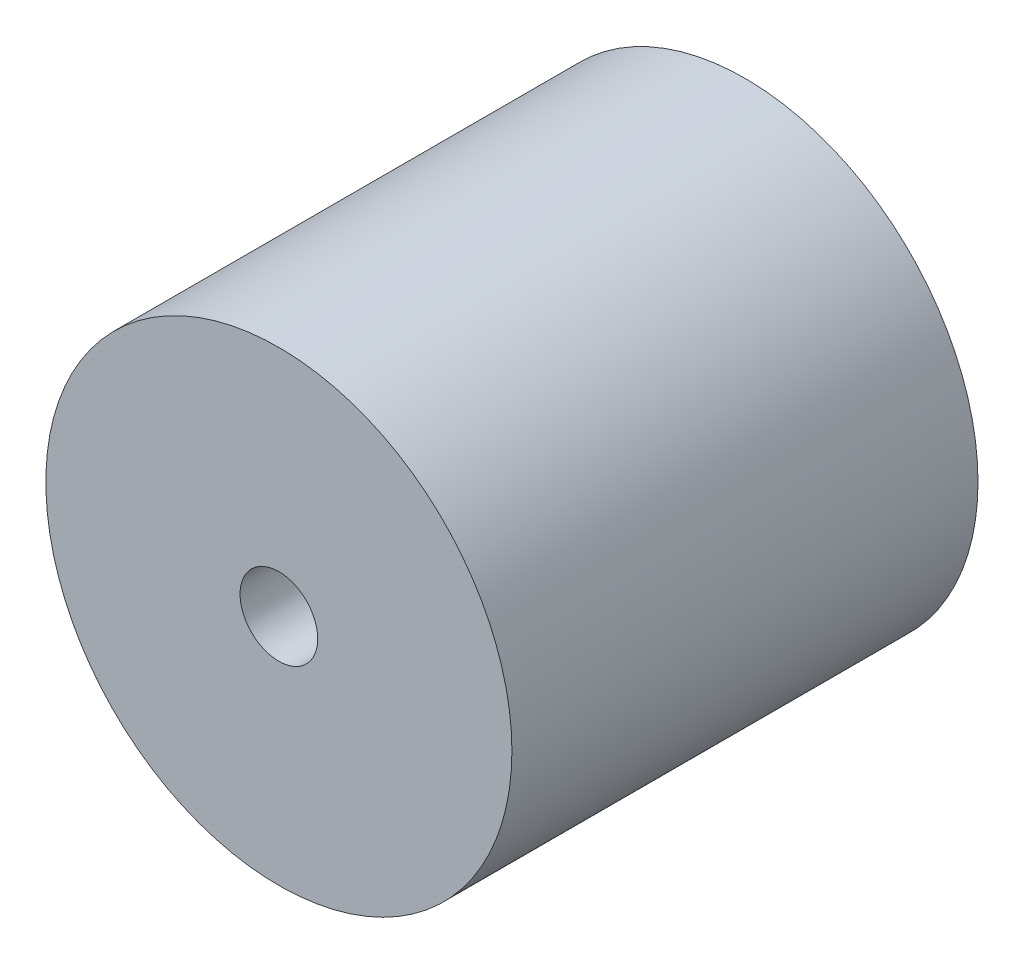
ISO-10303-21;
HEADER;
FILE_DESCRIPTION(('STEP AP214'),'2;1');
FILE_NAME('part.step','',(''),(''),'','','');
FILE_SCHEMA(('AUTOMOTIVE_DESIGN { 1 0 10303 214 1 1 1 1 }'));
ENDSEC;
DATA;
#1=APPLICATION_CONTEXT('core data for automotive mechanical design processes');
#2=APPLICATION_PROTOCOL_DEFINITION('international standard','automotive_design',2000,#1);
#3=PRODUCT_CONTEXT('',#1,'mechanical');
#4=PRODUCT('Part','Part','',(#3));
#5=PRODUCT_RELATED_PRODUCT_CATEGORY('part','',(#4));
#6=PRODUCT_DEFINITION_FORMATION('','',#4);
#7=PRODUCT_DEFINITION_CONTEXT('part definition',#1,'design');
#8=PRODUCT_DEFINITION('design','',#6,#7);
#9=PRODUCT_DEFINITION_SHAPE('','',#8);
#10=(LENGTH_UNIT() NAMED_UNIT(*) SI_UNIT(.MILLI.,.METRE.));
#11=(NAMED_UNIT(*) PLANE_ANGLE_UNIT() SI_UNIT($,.RADIAN.));
#12=(NAMED_UNIT(*) SI_UNIT($,.STERADIAN.) SOLID_ANGLE_UNIT());
#13=UNCERTAINTY_MEASURE_WITH_UNIT(LENGTH_MEASURE(1.E-05),#10,'distance_accuracy_value','');
#14=(GEOMETRIC_REPRESENTATION_CONTEXT(3) GLOBAL_UNCERTAINTY_ASSIGNED_CONTEXT((#13)) GLOBAL_UNIT_ASSIGNED_CONTEXT((#10,
#11,#12)) REPRESENTATION_CONTEXT('',''));
#15=CARTESIAN_POINT('',(0.,0.,0.));
#16=DIRECTION('',(0.,0.,1.));
#17=DIRECTION('',(1.,0.,0.));
#18=AXIS2_PLACEMENT_3D('',#15,#16,#17);
#19=CARTESIAN_POINT('',(0.,0.,60.));
#20=DIRECTION('',(0.,0.,-1.));
#21=DIRECTION('',(-1.,0.,0.));
#22=AXIS2_PLACEMENT_3D('',#19,#20,#21);
#23=CYLINDRICAL_SURFACE('',#22,30.);
#24=CARTESIAN_POINT('',(0.,0.,60.));
#25=DIRECTION('',(0.,0.,1.));
#26=DIRECTION('',(1.,0.,0.));
#27=AXIS2_PLACEMENT_3D('',#24,#25,#26);
#28=CIRCLE('',#27,30.);
#29=CARTESIAN_POINT('',(30.,0.,60.));
#30=VERTEX_POINT('',#29);
#31=EDGE_CURVE('E10',#30,#30,#28,.T.);
#32=ORIENTED_EDGE('',*,*,#31,.F.);
#33=EDGE_LOOP('',(#32));
#34=FACE_BOUND('',#33,.T.);
#35=CARTESIAN_POINT('',(0.,0.,0.));
#36=DIRECTION('',(0.,0.,1.));
#37=DIRECTION('',(1.,0.,0.));
#38=AXIS2_PLACEMENT_3D('',#35,#36,#37);
#39=CIRCLE('',#38,30.);
#40=CARTESIAN_POINT('',(30.,0.,0.));
#41=VERTEX_POINT('',#40);
#42=EDGE_CURVE('E34',#41,#41,#39,.T.);
#43=ORIENTED_EDGE('',*,*,#42,.T.);
#44=EDGE_LOOP('',(#43));
#45=FACE_BOUND('',#44,.T.);
#46=ADVANCED_FACE('F31',(#34,#45),#23,.T.);
#47=CARTESIAN_POINT('',(0.,0.,60.));
#48=DIRECTION('',(0.,0.,1.));
#49=DIRECTION('',(1.,0.,0.));
#50=AXIS2_PLACEMENT_3D('',#47,#48,#49);
#51=PLANE('',#50);
#52=CARTESIAN_POINT('',(0.,0.,60.));
#53=DIRECTION('',(0.,0.,1.));
#54=DIRECTION('',(1.,0.,0.));
#55=AXIS2_PLACEMENT_3D('',#52,#53,#54);
#56=CIRCLE('',#55,5.);
#57=CARTESIAN_POINT('',(5.,0.,60.));
#58=VERTEX_POINT('',#57);
#59=EDGE_CURVE('E43',#58,#58,#56,.T.);
#60=ORIENTED_EDGE('',*,*,#59,.F.);
#61=EDGE_LOOP('',(#60));
#62=FACE_BOUND('',#61,.T.);
#63=ORIENTED_EDGE('',*,*,#31,.T.);
#64=EDGE_LOOP('',(#63));
#65=FACE_BOUND('',#64,.T.);
#66=ADVANCED_FACE('F58',(#62,#65),#51,.T.);
#67=CARTESIAN_POINT('',(0.,0.,0.));
#68=DIRECTION('',(0.,0.,1.));
#69=DIRECTION('',(1.,0.,0.));
#70=AXIS2_PLACEMENT_3D('',#67,#68,#69);
#71=PLANE('',#70);
#72=CARTESIAN_POINT('',(0.,0.,0.));
#73=DIRECTION('',(0.,0.,1.));
#74=DIRECTION('',(1.,0.,0.));
#75=AXIS2_PLACEMENT_3D('',#72,#73,#74);
#76=CIRCLE('',#75,5.);
#77=CARTESIAN_POINT('',(5.,0.,0.));
#78=VERTEX_POINT('',#77);
#79=EDGE_CURVE('E41',#78,#78,#76,.T.);
#80=ORIENTED_EDGE('',*,*,#79,.T.);
#81=EDGE_LOOP('',(#80));
#82=FACE_BOUND('',#81,.T.);
#83=ORIENTED_EDGE('',*,*,#42,.F.);
#84=EDGE_LOOP('',(#83));
#85=FACE_BOUND('',#84,.T.);
#86=ADVANCED_FACE('F49',(#82,#85),#71,.F.);
#87=CARTESIAN_POINT('',(0.,0.,0.));
#88=DIRECTION('',(0.,0.,1.));
#89=DIRECTION('',(1.,0.,0.));
#90=AXIS2_PLACEMENT_3D('',#87,#88,#89);
#91=CYLINDRICAL_SURFACE('',#90,5.);
#92=ORIENTED_EDGE('',*,*,#79,.F.);
#93=EDGE_LOOP('',(#92));
#94=FACE_BOUND('',#93,.T.);
#95=ORIENTED_EDGE('',*,*,#59,.T.);
#96=EDGE_LOOP('',(#95));
#97=FACE_BOUND('',#96,.T.);
#98=ADVANCED_FACE('F52',(#94,#97),#91,.F.);
#99=CLOSED_SHELL('',(#46,#66,#86,#98));
#100=MANIFOLD_SOLID_BREP('B2',#99);
#101=ADVANCED_BREP_SHAPE_REPRESENTATION('',(#18,#100),#14);
#102=SHAPE_DEFINITION_REPRESENTATION(#9,#101);
ENDSEC;
END-ISO-10303-21;
